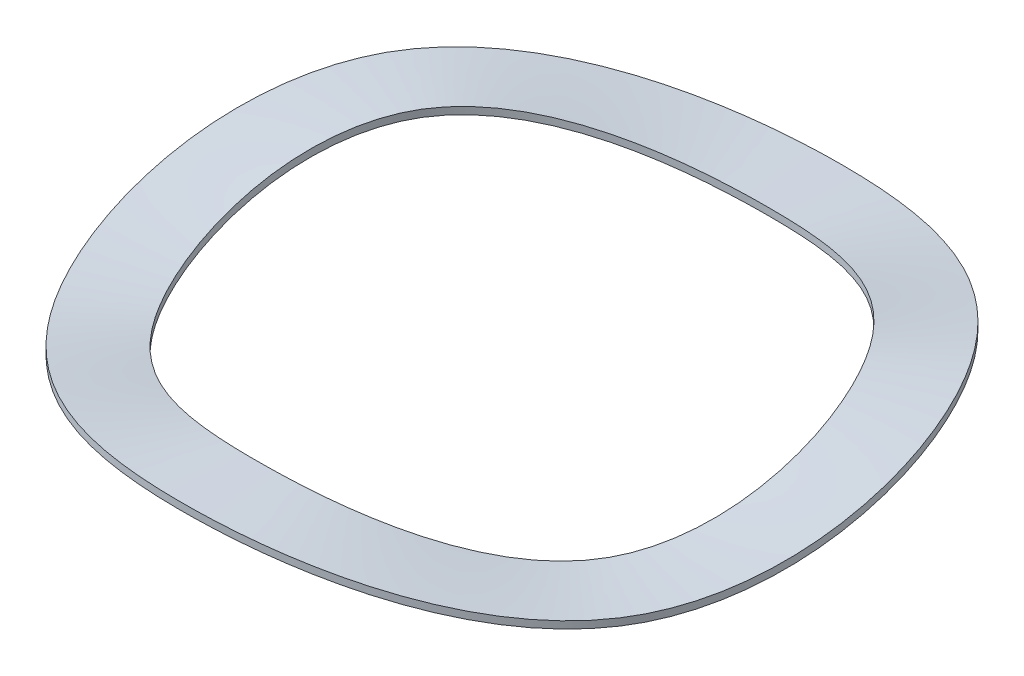
ISO-10303-21;
HEADER;
FILE_DESCRIPTION(('STEP AP214'),'2;1');
FILE_NAME('part.step','',(''),(''),'','','');
FILE_SCHEMA(('AUTOMOTIVE_DESIGN { 1 0 10303 214 1 1 1 1 }'));
ENDSEC;
DATA;
#1=APPLICATION_CONTEXT('core data for automotive mechanical design processes');
#2=APPLICATION_PROTOCOL_DEFINITION('international standard','automotive_design',2000,#1);
#3=PRODUCT_CONTEXT('',#1,'mechanical');
#4=PRODUCT('Part','Part','',(#3));
#5=PRODUCT_RELATED_PRODUCT_CATEGORY('part','',(#4));
#6=PRODUCT_DEFINITION_FORMATION('','',#4);
#7=PRODUCT_DEFINITION_CONTEXT('part definition',#1,'design');
#8=PRODUCT_DEFINITION('design','',#6,#7);
#9=PRODUCT_DEFINITION_SHAPE('','',#8);
#10=(LENGTH_UNIT() NAMED_UNIT(*) SI_UNIT(.MILLI.,.METRE.));
#11=(NAMED_UNIT(*) PLANE_ANGLE_UNIT() SI_UNIT($,.RADIAN.));
#12=(NAMED_UNIT(*) SI_UNIT($,.STERADIAN.) SOLID_ANGLE_UNIT());
#13=UNCERTAINTY_MEASURE_WITH_UNIT(LENGTH_MEASURE(1.E-05),#10,'distance_accuracy_value','');
#14=(GEOMETRIC_REPRESENTATION_CONTEXT(3) GLOBAL_UNCERTAINTY_ASSIGNED_CONTEXT((#13)) GLOBAL_UNIT_ASSIGNED_CONTEXT((#10,
#11,#12)) REPRESENTATION_CONTEXT('',''));
#15=CARTESIAN_POINT('',(0.,0.,0.));
#16=DIRECTION('',(0.,0.,1.));
#17=DIRECTION('',(1.,0.,0.));
#18=AXIS2_PLACEMENT_3D('',#15,#16,#17);
#19=CARTESIAN_POINT('',(0.,0.,-10.8712));
#20=CARTESIAN_POINT('',(3.76589414784855,0.,-10.8712));
#21=CARTESIAN_POINT('',(11.2976824435457,3.2004,-6.52272));
#22=CARTESIAN_POINT('',(11.2976824435456,-1.6002,6.52272000000004));
#23=CARTESIAN_POINT('',(0.,3.20039999999999,13.04544));
#24=CARTESIAN_POINT('',(-11.2976824435457,-1.6002,6.52271999999994));
#25=CARTESIAN_POINT('',(-11.2976824435456,1.6002,-2.17424000000005));
#26=CARTESIAN_POINT('',(-7.53178829569708,1.6002,-8.69696000000003));
#27=CARTESIAN_POINT('',(-3.76589414784855,0.,-10.8712));
#28=CARTESIAN_POINT('',(0.,0.,-10.8712));
#29=CARTESIAN_POINT('',(0.,0.,-11.9126));
#30=CARTESIAN_POINT('',(4.126645690049,0.,-11.9126));
#31=CARTESIAN_POINT('',(12.379937070147,3.2004,-7.14756000000001));
#32=CARTESIAN_POINT('',(12.379937070147,-1.6002,7.14756000000004));
#33=CARTESIAN_POINT('',(0.,3.20039999999999,14.29512));
#34=CARTESIAN_POINT('',(-12.3799370701471,-1.6002,7.14755999999993));
#35=CARTESIAN_POINT('',(-12.379937070147,1.6002,-2.38252000000005));
#36=CARTESIAN_POINT('',(-8.25329138009797,1.6002,-9.53008000000003));
#37=CARTESIAN_POINT('',(-4.12664569004899,0.,-11.9126));
#38=CARTESIAN_POINT('',(0.,0.,-11.9126));
#39=CARTESIAN_POINT('',(0.,0.,-12.954));
#40=CARTESIAN_POINT('',(4.48739723224945,0.,-12.954));
#41=CARTESIAN_POINT('',(13.4621916967484,3.2004,-7.77240000000001));
#42=CARTESIAN_POINT('',(13.4621916967483,-1.6002,7.77240000000005));
#43=CARTESIAN_POINT('',(0.,3.20039999999999,15.5448));
#44=CARTESIAN_POINT('',(-13.4621916967484,-1.6002,7.77239999999993));
#45=CARTESIAN_POINT('',(-13.4621916967483,1.6002,-2.59080000000006));
#46=CARTESIAN_POINT('',(-8.97479446449886,1.6002,-10.3632));
#47=CARTESIAN_POINT('',(-4.48739723224944,0.,-12.954));
#48=CARTESIAN_POINT('',(0.,0.,-12.954));
#49=CARTESIAN_POINT('',(0.,0.,-13.9954));
#50=CARTESIAN_POINT('',(4.84814877444989,0.,-13.9954));
#51=CARTESIAN_POINT('',(14.5444463233497,3.2004,-8.39724000000001));
#52=CARTESIAN_POINT('',(14.5444463233496,-1.6002,8.39724000000005));
#53=CARTESIAN_POINT('',(0.,3.20039999999999,16.79448));
#54=CARTESIAN_POINT('',(-14.5444463233498,-1.6002,8.39723999999993));
#55=CARTESIAN_POINT('',(-14.5444463233497,1.6002,-2.79908000000007));
#56=CARTESIAN_POINT('',(-9.69629754889975,1.6002,-11.19632));
#57=CARTESIAN_POINT('',(-4.84814877444989,0.,-13.9954));
#58=CARTESIAN_POINT('',(0.,0.,-13.9954));
#59=B_SPLINE_SURFACE_WITH_KNOTS('',3,3,((#19,#20,#21,#22,#23,#24,#25,#26,#27,#28),(#29,#30,#31,
#32,#33,#34,#35,#36,#37,#38),(#39,#40,#41,#42,#43,#44,#45,#46,#47,#48),(#49,#50,#51,#52,#53,#54,
#55,#56,#57,#58)),.UNSPECIFIED.,.F.,.T.,.F.,(4,4),(4,1,1,1,1,2,4),(0.,1.),(0.,0.166666666666667,
0.333333333333334,0.5,0.666666666666666,0.833333333333333,1.),.UNSPECIFIED.);
#60=CARTESIAN_POINT('',(0.,0.,-13.9954));
#61=CARTESIAN_POINT('',(4.84814877444989,0.,-13.9954));
#62=CARTESIAN_POINT('',(14.5444463233497,3.2004,-8.39724000000001));
#63=CARTESIAN_POINT('',(14.5444463233496,-1.6002,8.39724000000005));
#64=CARTESIAN_POINT('',(0.,3.20039999999999,16.79448));
#65=CARTESIAN_POINT('',(-14.5444463233498,-1.6002,8.39723999999993));
#66=CARTESIAN_POINT('',(-14.5444463233497,1.6002,-2.79908000000007));
#67=CARTESIAN_POINT('',(-9.69629754889975,1.6002,-11.19632));
#68=CARTESIAN_POINT('',(-4.84814877444989,0.,-13.9954));
#69=CARTESIAN_POINT('',(0.,0.,-13.9954));
#70=B_SPLINE_CURVE_WITH_KNOTS('',3,(#60,#61,#62,#63,#64,#65,#66,#67,#68,#69),.UNSPECIFIED.,.T.,
.F.,(4,1,1,1,1,2,4),(0.,0.166666666666667,0.333333333333334,0.5,0.666666666666666,
0.833333333333333,1.),.UNSPECIFIED.);
#71=CARTESIAN_POINT('',(0.,0.,-13.9954));
#72=VERTEX_POINT('',#71);
#73=EDGE_CURVE('E21',#72,#72,#70,.F.);
#74=CARTESIAN_POINT('',(0.,0.,-10.8712));
#75=CARTESIAN_POINT('',(3.76589414784855,0.,-10.8712));
#76=CARTESIAN_POINT('',(11.2976824435457,3.2004,-6.52272));
#77=CARTESIAN_POINT('',(11.2976824435456,-1.6002,6.52272000000004));
#78=CARTESIAN_POINT('',(0.,3.20039999999999,13.04544));
#79=CARTESIAN_POINT('',(-11.2976824435457,-1.6002,6.52271999999994));
#80=CARTESIAN_POINT('',(-11.2976824435456,1.6002,-2.17424000000005));
#81=CARTESIAN_POINT('',(-7.53178829569708,1.6002,-8.69696000000003));
#82=CARTESIAN_POINT('',(-3.76589414784855,0.,-10.8712));
#83=CARTESIAN_POINT('',(0.,0.,-10.8712));
#84=B_SPLINE_CURVE_WITH_KNOTS('',3,(#74,#75,#76,#77,#78,#79,#80,#81,#82,#83),.UNSPECIFIED.,.T.,
.F.,(4,1,1,1,1,2,4),(0.,0.166666666666667,0.333333333333334,0.5,0.666666666666666,
0.833333333333333,1.),.UNSPECIFIED.);
#85=CARTESIAN_POINT('',(0.,0.,-10.8712));
#86=VERTEX_POINT('',#85);
#87=EDGE_CURVE('E32',#86,#86,#84,.T.);
#88=ORIENTED_EDGE('',*,*,#73,.F.);
#89=EDGE_LOOP('',(#88));
#90=FACE_BOUND('',#89,.T.);
#91=ORIENTED_EDGE('',*,*,#87,.F.);
#92=EDGE_LOOP('',(#91));
#93=FACE_BOUND('',#92,.T.);
#94=ADVANCED_FACE('F15',(#90,#93),#59,.T.);
#95=CARTESIAN_POINT('',(0.,0.,-13.9954));
#96=CARTESIAN_POINT('',(4.84814877444989,0.,-13.9954));
#97=CARTESIAN_POINT('',(14.5444463233497,3.2004,-8.39724000000001));
#98=CARTESIAN_POINT('',(14.5444463233496,-1.6002,8.39724000000005));
#99=CARTESIAN_POINT('',(0.,3.20039999999999,16.79448));
#100=CARTESIAN_POINT('',(-14.5444463233498,-1.6002,8.39723999999993));
#101=CARTESIAN_POINT('',(-14.5444463233497,1.6002,-2.79908000000007));
#102=CARTESIAN_POINT('',(-9.69629754889975,1.6002,-11.19632));
#103=CARTESIAN_POINT('',(-4.84814877444989,0.,-13.9954));
#104=CARTESIAN_POINT('',(0.,0.,-13.9954));
#105=CARTESIAN_POINT('',(0.,0.1016,-13.9954));
#106=CARTESIAN_POINT('',(4.84814877444989,0.101599999999999,-13.9954));
#107=CARTESIAN_POINT('',(14.5444463233497,3.302,-8.39724000000001));
#108=CARTESIAN_POINT('',(14.5444463233496,-1.4986,8.39724000000005));
#109=CARTESIAN_POINT('',(0.,3.30199999999999,16.79448));
#110=CARTESIAN_POINT('',(-14.5444463233498,-1.4986,8.39723999999993));
#111=CARTESIAN_POINT('',(-14.5444463233497,1.7018,-2.79908000000007));
#112=CARTESIAN_POINT('',(-9.69629754889975,1.7018,-11.19632));
#113=CARTESIAN_POINT('',(-4.84814877444989,0.101600000000001,-13.9954));
#114=CARTESIAN_POINT('',(0.,0.1016,-13.9954));
#115=CARTESIAN_POINT('',(0.,0.2032,-13.9954));
#116=CARTESIAN_POINT('',(4.84814877444989,0.203199999999999,-13.9954));
#117=CARTESIAN_POINT('',(14.5444463233497,3.4036,-8.39724000000001));
#118=CARTESIAN_POINT('',(14.5444463233496,-1.397,8.39724000000005));
#119=CARTESIAN_POINT('',(0.,3.40359999999999,16.79448));
#120=CARTESIAN_POINT('',(-14.5444463233498,-1.397,8.39723999999993));
#121=CARTESIAN_POINT('',(-14.5444463233497,1.8034,-2.79908000000007));
#122=CARTESIAN_POINT('',(-9.69629754889975,1.8034,-11.19632));
#123=CARTESIAN_POINT('',(-4.84814877444989,0.203200000000001,-13.9954));
#124=CARTESIAN_POINT('',(0.,0.2032,-13.9954));
#125=CARTESIAN_POINT('',(0.,0.3048,-13.9954));
#126=CARTESIAN_POINT('',(4.84814877444989,0.304799999999999,-13.9954));
#127=CARTESIAN_POINT('',(14.5444463233497,3.5052,-8.39724000000001));
#128=CARTESIAN_POINT('',(14.5444463233496,-1.2954,8.39724000000005));
#129=CARTESIAN_POINT('',(0.,3.50519999999999,16.79448));
#130=CARTESIAN_POINT('',(-14.5444463233498,-1.2954,8.39723999999993));
#131=CARTESIAN_POINT('',(-14.5444463233497,1.905,-2.79908000000007));
#132=CARTESIAN_POINT('',(-9.69629754889975,1.905,-11.19632));
#133=CARTESIAN_POINT('',(-4.84814877444989,0.304800000000001,-13.9954));
#134=CARTESIAN_POINT('',(0.,0.3048,-13.9954));
#135=B_SPLINE_SURFACE_WITH_KNOTS('',3,3,((#95,#96,#97,#98,#99,#100,#101,#102,#103,#104),(#105,
#106,#107,#108,#109,#110,#111,#112,#113,#114),(#115,#116,#117,#118,#119,#120,#121,#122,#123,
#124),(#125,#126,#127,#128,#129,#130,#131,#132,#133,#134)),.UNSPECIFIED.,.F.,.T.,.F.,(4,4),(4,1,
1,1,1,2,4),(0.,1.),(0.,0.166666666666667,0.333333333333334,0.5,0.666666666666666,
0.833333333333333,1.),.UNSPECIFIED.);
#136=CARTESIAN_POINT('',(0.,0.3048,-13.9954));
#137=CARTESIAN_POINT('',(4.84814877444989,0.304799999999999,-13.9954));
#138=CARTESIAN_POINT('',(14.5444463233497,3.5052,-8.39724000000001));
#139=CARTESIAN_POINT('',(14.5444463233496,-1.2954,8.39724000000005));
#140=CARTESIAN_POINT('',(0.,3.50519999999999,16.79448));
#141=CARTESIAN_POINT('',(-14.5444463233498,-1.2954,8.39723999999993));
#142=CARTESIAN_POINT('',(-14.5444463233497,1.905,-2.79908000000007));
#143=CARTESIAN_POINT('',(-9.69629754889975,1.905,-11.19632));
#144=CARTESIAN_POINT('',(-4.84814877444989,0.304800000000001,-13.9954));
#145=CARTESIAN_POINT('',(0.,0.3048,-13.9954));
#146=B_SPLINE_CURVE_WITH_KNOTS('',3,(#136,#137,#138,#139,#140,#141,#142,#143,#144,#145),
.UNSPECIFIED.,.T.,.F.,(4,1,1,1,1,2,4),(0.,0.166666666666667,0.333333333333334,0.5,
0.666666666666666,0.833333333333333,1.),.UNSPECIFIED.);
#147=CARTESIAN_POINT('',(0.,0.3048,-13.9954));
#148=VERTEX_POINT('',#147);
#149=EDGE_CURVE('E27',#148,#148,#146,.F.);
#150=ORIENTED_EDGE('',*,*,#149,.F.);
#151=EDGE_LOOP('',(#150));
#152=FACE_BOUND('',#151,.T.);
#153=ORIENTED_EDGE('',*,*,#73,.T.);
#154=EDGE_LOOP('',(#153));
#155=FACE_BOUND('',#154,.T.);
#156=ADVANCED_FACE('F55',(#152,#155),#135,.T.);
#157=CARTESIAN_POINT('',(0.,0.3048,-10.8712));
#158=CARTESIAN_POINT('',(3.76589414784855,0.304799999999998,-10.8712));
#159=CARTESIAN_POINT('',(11.2976824435457,3.5052,-6.52272));
#160=CARTESIAN_POINT('',(11.2976824435456,-1.2954,6.52272000000004));
#161=CARTESIAN_POINT('',(0.,3.5052,13.04544));
#162=CARTESIAN_POINT('',(-11.2976824435457,-1.29540000000002,6.52271999999994));
#163=CARTESIAN_POINT('',(-11.2976824435456,1.905,-2.17424000000005));
#164=CARTESIAN_POINT('',(-7.53178829569708,1.905,-8.69696000000003));
#165=CARTESIAN_POINT('',(-3.76589414784855,0.304800000000001,-10.8712));
#166=CARTESIAN_POINT('',(0.,0.3048,-10.8712));
#167=CARTESIAN_POINT('',(0.,0.2032,-10.8712));
#168=CARTESIAN_POINT('',(3.76589414784855,0.203199999999998,-10.8712));
#169=CARTESIAN_POINT('',(11.2976824435457,3.4036,-6.52272));
#170=CARTESIAN_POINT('',(11.2976824435456,-1.397,6.52272000000004));
#171=CARTESIAN_POINT('',(0.,3.4036,13.04544));
#172=CARTESIAN_POINT('',(-11.2976824435457,-1.39700000000001,6.52271999999994));
#173=CARTESIAN_POINT('',(-11.2976824435456,1.8034,-2.17424000000005));
#174=CARTESIAN_POINT('',(-7.53178829569708,1.8034,-8.69696000000003));
#175=CARTESIAN_POINT('',(-3.76589414784855,0.203200000000001,-10.8712));
#176=CARTESIAN_POINT('',(0.,0.2032,-10.8712));
#177=CARTESIAN_POINT('',(0.,0.1016,-10.8712));
#178=CARTESIAN_POINT('',(3.76589414784855,0.101599999999999,-10.8712));
#179=CARTESIAN_POINT('',(11.2976824435457,3.302,-6.52272));
#180=CARTESIAN_POINT('',(11.2976824435456,-1.4986,6.52272000000004));
#181=CARTESIAN_POINT('',(0.,3.302,13.04544));
#182=CARTESIAN_POINT('',(-11.2976824435457,-1.49860000000001,6.52271999999994));
#183=CARTESIAN_POINT('',(-11.2976824435456,1.7018,-2.17424000000005));
#184=CARTESIAN_POINT('',(-7.53178829569708,1.7018,-8.69696000000003));
#185=CARTESIAN_POINT('',(-3.76589414784855,0.101600000000001,-10.8712));
#186=CARTESIAN_POINT('',(0.,0.1016,-10.8712));
#187=CARTESIAN_POINT('',(0.,0.,-10.8712));
#188=CARTESIAN_POINT('',(3.76589414784855,0.,-10.8712));
#189=CARTESIAN_POINT('',(11.2976824435457,3.2004,-6.52272));
#190=CARTESIAN_POINT('',(11.2976824435456,-1.6002,6.52272000000004));
#191=CARTESIAN_POINT('',(0.,3.20039999999999,13.04544));
#192=CARTESIAN_POINT('',(-11.2976824435457,-1.6002,6.52271999999994));
#193=CARTESIAN_POINT('',(-11.2976824435456,1.6002,-2.17424000000005));
#194=CARTESIAN_POINT('',(-7.53178829569708,1.6002,-8.69696000000003));
#195=CARTESIAN_POINT('',(-3.76589414784855,0.,-10.8712));
#196=CARTESIAN_POINT('',(0.,0.,-10.8712));
#197=B_SPLINE_SURFACE_WITH_KNOTS('',3,3,((#157,#158,#159,#160,#161,#162,#163,#164,#165,#166),
(#167,#168,#169,#170,#171,#172,#173,#174,#175,#176),(#177,#178,#179,#180,#181,#182,#183,#184,
#185,#186),(#187,#188,#189,#190,#191,#192,#193,#194,#195,#196)),.UNSPECIFIED.,.F.,.T.,.F.,(4,4),
(4,1,1,1,1,2,4),(0.,1.),(0.,0.166666666666667,0.333333333333334,0.5,0.666666666666666,
0.833333333333333,1.),.UNSPECIFIED.);
#198=CARTESIAN_POINT('',(0.,0.3048,-10.8712));
#199=CARTESIAN_POINT('',(3.76589414784855,0.304799999999998,-10.8712));
#200=CARTESIAN_POINT('',(11.2976824435457,3.5052,-6.52272));
#201=CARTESIAN_POINT('',(11.2976824435456,-1.2954,6.52272000000004));
#202=CARTESIAN_POINT('',(0.,3.5052,13.04544));
#203=CARTESIAN_POINT('',(-11.2976824435457,-1.29540000000002,6.52271999999994));
#204=CARTESIAN_POINT('',(-11.2976824435456,1.905,-2.17424000000005));
#205=CARTESIAN_POINT('',(-7.53178829569708,1.905,-8.69696000000003));
#206=CARTESIAN_POINT('',(-3.76589414784855,0.304800000000001,-10.8712));
#207=CARTESIAN_POINT('',(0.,0.3048,-10.8712));
#208=B_SPLINE_CURVE_WITH_KNOTS('',3,(#198,#199,#200,#201,#202,#203,#204,#205,#206,#207),
.UNSPECIFIED.,.T.,.F.,(4,1,1,1,1,2,4),(0.,0.166666666666667,0.333333333333334,0.5,
0.666666666666666,0.833333333333333,1.),.UNSPECIFIED.);
#209=CARTESIAN_POINT('',(0.,0.3048,-10.8712));
#210=VERTEX_POINT('',#209);
#211=EDGE_CURVE('E10',#210,#210,#208,.T.);
#212=ORIENTED_EDGE('',*,*,#87,.T.);
#213=EDGE_LOOP('',(#212));
#214=FACE_BOUND('',#213,.T.);
#215=ORIENTED_EDGE('',*,*,#211,.F.);
#216=EDGE_LOOP('',(#215));
#217=FACE_BOUND('',#216,.T.);
#218=ADVANCED_FACE('F64',(#214,#217),#197,.T.);
#219=CARTESIAN_POINT('',(0.,0.3048,-13.9954));
#220=CARTESIAN_POINT('',(4.84814877444989,0.304799999999999,-13.9954));
#221=CARTESIAN_POINT('',(14.5444463233497,3.5052,-8.39724000000001));
#222=CARTESIAN_POINT('',(14.5444463233496,-1.2954,8.39724000000005));
#223=CARTESIAN_POINT('',(0.,3.50519999999999,16.79448));
#224=CARTESIAN_POINT('',(-14.5444463233498,-1.2954,8.39723999999993));
#225=CARTESIAN_POINT('',(-14.5444463233497,1.905,-2.79908000000007));
#226=CARTESIAN_POINT('',(-9.69629754889975,1.905,-11.19632));
#227=CARTESIAN_POINT('',(-4.84814877444989,0.304800000000001,-13.9954));
#228=CARTESIAN_POINT('',(0.,0.3048,-13.9954));
#229=CARTESIAN_POINT('',(0.,0.3048,-12.954));
#230=CARTESIAN_POINT('',(4.48739723224945,0.304799999999999,-12.954));
#231=CARTESIAN_POINT('',(13.4621916967484,3.5052,-7.77240000000001));
#232=CARTESIAN_POINT('',(13.4621916967483,-1.2954,7.77240000000005));
#233=CARTESIAN_POINT('',(0.,3.5052,15.5448));
#234=CARTESIAN_POINT('',(-13.4621916967484,-1.29540000000001,7.77239999999993));
#235=CARTESIAN_POINT('',(-13.4621916967483,1.905,-2.59080000000006));
#236=CARTESIAN_POINT('',(-8.97479446449886,1.905,-10.3632));
#237=CARTESIAN_POINT('',(-4.48739723224944,0.304800000000001,-12.954));
#238=CARTESIAN_POINT('',(0.,0.3048,-12.954));
#239=CARTESIAN_POINT('',(0.,0.3048,-11.9126));
#240=CARTESIAN_POINT('',(4.126645690049,0.304799999999998,-11.9126));
#241=CARTESIAN_POINT('',(12.379937070147,3.5052,-7.14756));
#242=CARTESIAN_POINT('',(12.379937070147,-1.2954,7.14756000000004));
#243=CARTESIAN_POINT('',(0.,3.5052,14.29512));
#244=CARTESIAN_POINT('',(-12.3799370701471,-1.29540000000001,7.14755999999993));
#245=CARTESIAN_POINT('',(-12.379937070147,1.905,-2.38252000000005));
#246=CARTESIAN_POINT('',(-8.25329138009797,1.905,-9.53008000000003));
#247=CARTESIAN_POINT('',(-4.12664569004899,0.304800000000001,-11.9126));
#248=CARTESIAN_POINT('',(0.,0.3048,-11.9126));
#249=CARTESIAN_POINT('',(0.,0.3048,-10.8712));
#250=CARTESIAN_POINT('',(3.76589414784855,0.304799999999998,-10.8712));
#251=CARTESIAN_POINT('',(11.2976824435457,3.5052,-6.52272));
#252=CARTESIAN_POINT('',(11.2976824435456,-1.2954,6.52272000000004));
#253=CARTESIAN_POINT('',(0.,3.5052,13.04544));
#254=CARTESIAN_POINT('',(-11.2976824435457,-1.29540000000002,6.52271999999994));
#255=CARTESIAN_POINT('',(-11.2976824435456,1.905,-2.17424000000005));
#256=CARTESIAN_POINT('',(-7.53178829569708,1.905,-8.69696000000003));
#257=CARTESIAN_POINT('',(-3.76589414784855,0.304800000000001,-10.8712));
#258=CARTESIAN_POINT('',(0.,0.3048,-10.8712));
#259=B_SPLINE_SURFACE_WITH_KNOTS('',3,3,((#219,#220,#221,#222,#223,#224,#225,#226,#227,#228),
(#229,#230,#231,#232,#233,#234,#235,#236,#237,#238),(#239,#240,#241,#242,#243,#244,#245,#246,
#247,#248),(#249,#250,#251,#252,#253,#254,#255,#256,#257,#258)),.UNSPECIFIED.,.F.,.T.,.F.,(4,4),
(4,1,1,1,1,2,4),(0.,1.),(0.,0.166666666666667,0.333333333333334,0.5,0.666666666666666,
0.833333333333333,1.),.UNSPECIFIED.);
#260=ORIENTED_EDGE('',*,*,#211,.T.);
#261=EDGE_LOOP('',(#260));
#262=FACE_BOUND('',#261,.T.);
#263=ORIENTED_EDGE('',*,*,#149,.T.);
#264=EDGE_LOOP('',(#263));
#265=FACE_BOUND('',#264,.T.);
#266=ADVANCED_FACE('F17',(#262,#265),#259,.T.);
#267=CLOSED_SHELL('',(#94,#156,#218,#266));
#268=MANIFOLD_SOLID_BREP('B1',#267);
#269=ADVANCED_BREP_SHAPE_REPRESENTATION('',(#18,#268),#14);
#270=SHAPE_DEFINITION_REPRESENTATION(#9,#269);
ENDSEC;
END-ISO-10303-21;
